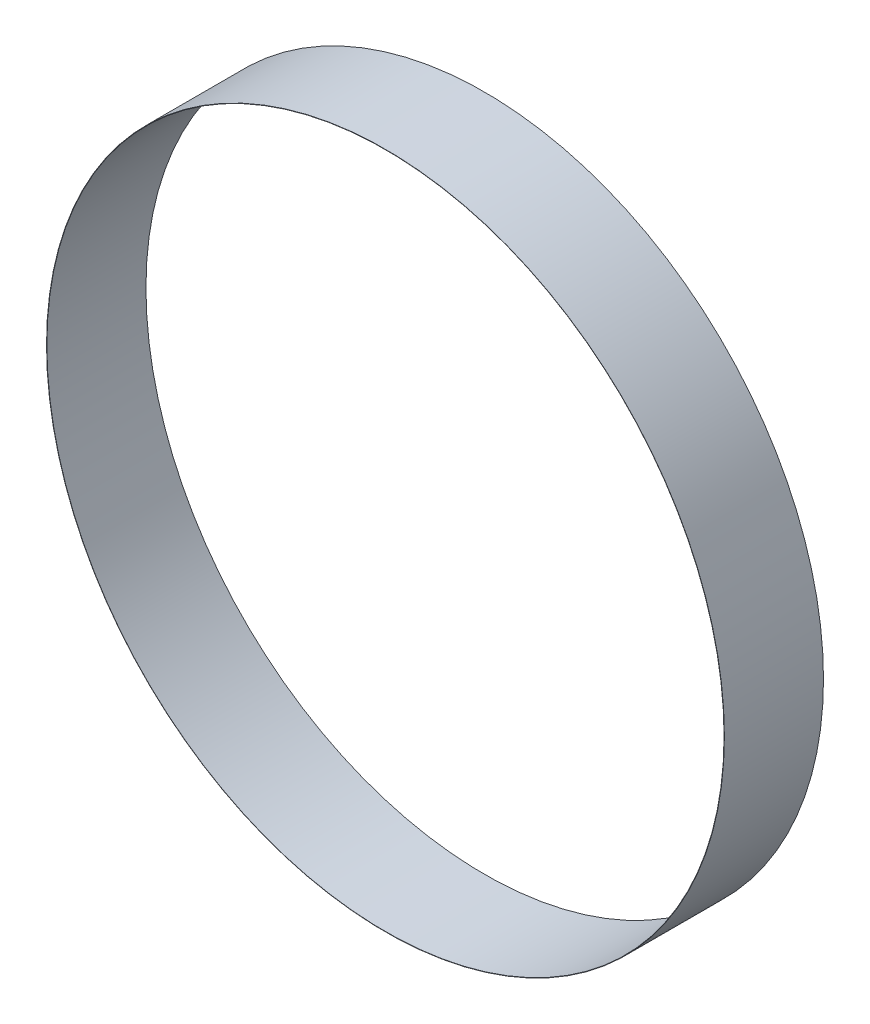
ISO-10303-21;
HEADER;
FILE_DESCRIPTION(('STEP AP214'),'2;1');
FILE_NAME('part.step','',(''),(''),'','','');
FILE_SCHEMA(('AUTOMOTIVE_DESIGN { 1 0 10303 214 1 1 1 1 }'));
ENDSEC;
DATA;
#1=APPLICATION_CONTEXT('core data for automotive mechanical design processes');
#2=APPLICATION_PROTOCOL_DEFINITION('international standard','automotive_design',2000,#1);
#3=PRODUCT_CONTEXT('',#1,'mechanical');
#4=PRODUCT('Part','Part','',(#3));
#5=PRODUCT_RELATED_PRODUCT_CATEGORY('part','',(#4));
#6=PRODUCT_DEFINITION_FORMATION('','',#4);
#7=PRODUCT_DEFINITION_CONTEXT('part definition',#1,'design');
#8=PRODUCT_DEFINITION('design','',#6,#7);
#9=PRODUCT_DEFINITION_SHAPE('','',#8);
#10=(LENGTH_UNIT() NAMED_UNIT(*) SI_UNIT(.MILLI.,.METRE.));
#11=(NAMED_UNIT(*) PLANE_ANGLE_UNIT() SI_UNIT($,.RADIAN.));
#12=(NAMED_UNIT(*) SI_UNIT($,.STERADIAN.) SOLID_ANGLE_UNIT());
#13=UNCERTAINTY_MEASURE_WITH_UNIT(LENGTH_MEASURE(1.E-05),#10,'distance_accuracy_value','');
#14=(GEOMETRIC_REPRESENTATION_CONTEXT(3) GLOBAL_UNCERTAINTY_ASSIGNED_CONTEXT((#13)) GLOBAL_UNIT_ASSIGNED_CONTEXT((#10,
#11,#12)) REPRESENTATION_CONTEXT('',''));
#15=CARTESIAN_POINT('',(0.,0.,0.));
#16=DIRECTION('',(0.,0.,1.));
#17=DIRECTION('',(1.,0.,0.));
#18=AXIS2_PLACEMENT_3D('',#15,#16,#17);
#19=CARTESIAN_POINT('',(0.,0.,30.));
#20=DIRECTION('',(0.,0.,1.));
#21=DIRECTION('',(1.,0.,0.));
#22=AXIS2_PLACEMENT_3D('',#19,#20,#21);
#23=PLANE('',#22);
#24=CARTESIAN_POINT('',(0.,0.,30.));
#25=DIRECTION('',(0.,0.,1.));
#26=DIRECTION('',(1.,0.,0.));
#27=AXIS2_PLACEMENT_3D('',#24,#25,#26);
#28=CIRCLE('',#27,102.6);
#29=CARTESIAN_POINT('',(102.6,0.,30.));
#30=VERTEX_POINT('',#29);
#31=EDGE_CURVE('E10',#30,#30,#28,.T.);
#32=ORIENTED_EDGE('',*,*,#31,.T.);
#33=EDGE_LOOP('',(#32));
#34=FACE_BOUND('',#33,.T.);
#35=CARTESIAN_POINT('',(0.,0.,30.));
#36=DIRECTION('',(0.,0.,1.));
#37=DIRECTION('',(1.,0.,0.));
#38=AXIS2_PLACEMENT_3D('',#35,#36,#37);
#39=CIRCLE('',#38,102.5);
#40=CARTESIAN_POINT('',(102.5,0.,30.));
#41=VERTEX_POINT('',#40);
#42=EDGE_CURVE('E44',#41,#41,#39,.T.);
#43=ORIENTED_EDGE('',*,*,#42,.F.);
#44=EDGE_LOOP('',(#43));
#45=FACE_BOUND('',#44,.T.);
#46=ADVANCED_FACE('F33',(#34,#45),#23,.T.);
#47=CARTESIAN_POINT('',(0.,0.,0.));
#48=DIRECTION('',(0.,0.,1.));
#49=DIRECTION('',(1.,0.,0.));
#50=AXIS2_PLACEMENT_3D('',#47,#48,#49);
#51=PLANE('',#50);
#52=CARTESIAN_POINT('',(0.,0.,0.));
#53=DIRECTION('',(0.,0.,1.));
#54=DIRECTION('',(1.,0.,0.));
#55=AXIS2_PLACEMENT_3D('',#52,#53,#54);
#56=CIRCLE('',#55,102.6);
#57=CARTESIAN_POINT('',(102.6,0.,0.));
#58=VERTEX_POINT('',#57);
#59=EDGE_CURVE('E37',#58,#58,#56,.T.);
#60=ORIENTED_EDGE('',*,*,#59,.F.);
#61=EDGE_LOOP('',(#60));
#62=FACE_BOUND('',#61,.T.);
#63=CARTESIAN_POINT('',(0.,0.,0.));
#64=DIRECTION('',(0.,0.,1.));
#65=DIRECTION('',(1.,0.,0.));
#66=AXIS2_PLACEMENT_3D('',#63,#64,#65);
#67=CIRCLE('',#66,102.5);
#68=CARTESIAN_POINT('',(102.5,0.,0.));
#69=VERTEX_POINT('',#68);
#70=EDGE_CURVE('E46',#69,#69,#67,.T.);
#71=ORIENTED_EDGE('',*,*,#70,.T.);
#72=EDGE_LOOP('',(#71));
#73=FACE_BOUND('',#72,.T.);
#74=ADVANCED_FACE('F56',(#62,#73),#51,.F.);
#75=CARTESIAN_POINT('',(0.,0.,30.));
#76=DIRECTION('',(0.,0.,-1.));
#77=DIRECTION('',(-1.,0.,0.));
#78=AXIS2_PLACEMENT_3D('',#75,#76,#77);
#79=CYLINDRICAL_SURFACE('',#78,102.6);
#80=ORIENTED_EDGE('',*,*,#31,.F.);
#81=EDGE_LOOP('',(#80));
#82=FACE_BOUND('',#81,.T.);
#83=ORIENTED_EDGE('',*,*,#59,.T.);
#84=EDGE_LOOP('',(#83));
#85=FACE_BOUND('',#84,.T.);
#86=ADVANCED_FACE('F35',(#82,#85),#79,.T.);
#87=CARTESIAN_POINT('',(0.,0.,30.));
#88=DIRECTION('',(0.,0.,-1.));
#89=DIRECTION('',(-1.,0.,0.));
#90=AXIS2_PLACEMENT_3D('',#87,#88,#89);
#91=CYLINDRICAL_SURFACE('',#90,102.5);
#92=ORIENTED_EDGE('',*,*,#42,.T.);
#93=EDGE_LOOP('',(#92));
#94=FACE_BOUND('',#93,.T.);
#95=ORIENTED_EDGE('',*,*,#70,.F.);
#96=EDGE_LOOP('',(#95));
#97=FACE_BOUND('',#96,.T.);
#98=ADVANCED_FACE('F52',(#94,#97),#91,.F.);
#99=CLOSED_SHELL('',(#46,#74,#86,#98));
#100=MANIFOLD_SOLID_BREP('B2',#99);
#101=ADVANCED_BREP_SHAPE_REPRESENTATION('',(#18,#100),#14);
#102=SHAPE_DEFINITION_REPRESENTATION(#9,#101);
ENDSEC;
END-ISO-10303-21;
